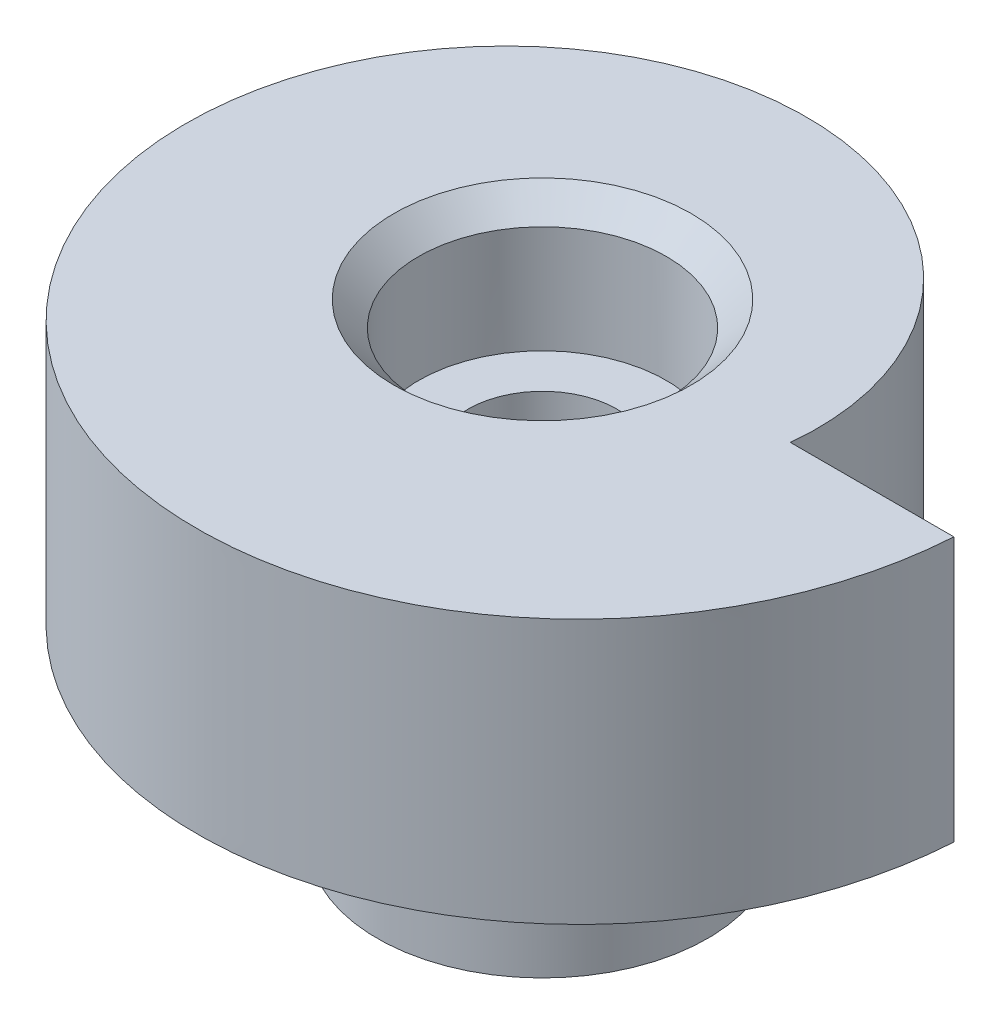
ISO-10303-21;
HEADER;
FILE_DESCRIPTION(('STEP AP214'),'2;1');
FILE_NAME('part.step','',(''),(''),'','','');
FILE_SCHEMA(('AUTOMOTIVE_DESIGN { 1 0 10303 214 1 1 1 1 }'));
ENDSEC;
DATA;
#1=APPLICATION_CONTEXT('core data for automotive mechanical design processes');
#2=APPLICATION_PROTOCOL_DEFINITION('international standard','automotive_design',2000,#1);
#3=PRODUCT_CONTEXT('',#1,'mechanical');
#4=PRODUCT('Part','Part','',(#3));
#5=PRODUCT_RELATED_PRODUCT_CATEGORY('part','',(#4));
#6=PRODUCT_DEFINITION_FORMATION('','',#4);
#7=PRODUCT_DEFINITION_CONTEXT('part definition',#1,'design');
#8=PRODUCT_DEFINITION('design','',#6,#7);
#9=PRODUCT_DEFINITION_SHAPE('','',#8);
#10=(LENGTH_UNIT() NAMED_UNIT(*) SI_UNIT(.MILLI.,.METRE.));
#11=(NAMED_UNIT(*) PLANE_ANGLE_UNIT() SI_UNIT($,.RADIAN.));
#12=(NAMED_UNIT(*) SI_UNIT($,.STERADIAN.) SOLID_ANGLE_UNIT());
#13=UNCERTAINTY_MEASURE_WITH_UNIT(LENGTH_MEASURE(1.E-05),#10,'distance_accuracy_value','');
#14=(GEOMETRIC_REPRESENTATION_CONTEXT(3) GLOBAL_UNCERTAINTY_ASSIGNED_CONTEXT((#13)) GLOBAL_UNIT_ASSIGNED_CONTEXT((#10,
#11,#12)) REPRESENTATION_CONTEXT('',''));
#15=CARTESIAN_POINT('',(0.,0.,0.));
#16=DIRECTION('',(0.,0.,1.));
#17=DIRECTION('',(1.,0.,0.));
#18=AXIS2_PLACEMENT_3D('',#15,#16,#17);
#19=CARTESIAN_POINT('',(-7.62869291223014,0.,3.05998988633623));
#20=DIRECTION('',(0.,-1.,0.));
#21=DIRECTION('',(0.,0.,-1.));
#22=AXIS2_PLACEMENT_3D('',#19,#20,#21);
#23=PLANE('',#22);
#24=CARTESIAN_POINT('',(0.,0.,0.));
#25=DIRECTION('',(0.,-1.,0.));
#26=DIRECTION('',(0.,0.,-1.));
#27=AXIS2_PLACEMENT_3D('',#24,#25,#26);
#28=CIRCLE('',#27,5.65);
#29=CARTESIAN_POINT('',(0.,0.,-5.65));
#30=VERTEX_POINT('',#29);
#31=EDGE_CURVE('E139',#30,#30,#28,.T.);
#32=ORIENTED_EDGE('',*,*,#31,.F.);
#33=EDGE_LOOP('',(#32));
#34=FACE_BOUND('',#33,.T.);
#35=CARTESIAN_POINT('',(6.0000000000256,0.,-2.4375611801459E-10));
#36=CARTESIAN_POINT('',(6.00227211322281,0.,-0.0216391735623261));
#37=CARTESIAN_POINT('',(6.00652940736587,0.,-0.064971678314864));
#38=CARTESIAN_POINT('',(6.0151125979966,0.,-0.163427406914795));
#39=CARTESIAN_POINT('',(6.02477550925084,0.,-0.304129477528617));
#40=CARTESIAN_POINT('',(6.03047893393323,0.,-0.43480921102798));
#41=CARTESIAN_POINT('',(6.03333443386326,0.,-0.586716981964261));
#42=CARTESIAN_POINT('',(6.03269058254121,0.,-0.738270410172744));
#43=CARTESIAN_POINT('',(6.02717988389836,0.,-0.917587713881191));
#44=CARTESIAN_POINT('',(6.01061545066083,0.,-1.17231334580709));
#45=CARTESIAN_POINT('',(5.97706980435562,0.,-1.47675832118602));
#46=CARTESIAN_POINT('',(5.91823629162269,0.,-1.82950111634226));
#47=CARTESIAN_POINT('',(5.82442725919943,0.,-2.22717229059439));
#48=CARTESIAN_POINT('',(5.7046521139346,0.,-2.61786696334865));
#49=CARTESIAN_POINT('',(5.55958646798802,0.,-2.99985438146384));
#50=CARTESIAN_POINT('',(5.39001539784242,0.,-3.37162892965646));
#51=CARTESIAN_POINT('',(5.19680319018417,0.,-3.73166841207894));
#52=CARTESIAN_POINT('',(4.98089884731563,0.,-4.07857837498762));
#53=CARTESIAN_POINT('',(4.68393346374007,0.,-4.49412556995533));
#54=CARTESIAN_POINT('',(4.28641768347438,0.,-4.96134695883234));
#55=CARTESIAN_POINT('',(3.7676822884361,0.,-5.45550000666804));
#56=CARTESIAN_POINT('',(3.10952771569555,0.,-5.94248264214372));
#57=CARTESIAN_POINT('',(2.39677626735348,0.,-6.34525339556019));
#58=CARTESIAN_POINT('',(1.64056828888228,0.,-6.65881676590082));
#59=CARTESIAN_POINT('',(0.655269827021516,0.,-6.93485809977588));
#60=CARTESIAN_POINT('',(-0.364309039480111,0.,-7.0528097959619));
#61=CARTESIAN_POINT('',(-1.38957544648513,0.,-7.0108988181884));
#62=CARTESIAN_POINT('',(-2.59420727579667,0.,-6.77430744231128));
#63=CARTESIAN_POINT('',(-3.75258395876377,0.,-6.35736857247431));
#64=CARTESIAN_POINT('',(-4.99396666945988,0.,-5.62570406505568));
#65=CARTESIAN_POINT('',(-6.19559601711012,0.,-4.50038196485773));
#66=CARTESIAN_POINT('',(-7.12775993762066,0.,-3.14392340940698));
#67=CARTESIAN_POINT('',(-7.87695686030534,0.,-1.3203660612925));
#68=CARTESIAN_POINT('',(-8.18009594788286,0.,1.05994904943934));
#69=CARTESIAN_POINT('',(-7.69939025058489,0.,3.43539064774587));
#70=CARTESIAN_POINT('',(-6.51239127492808,0.,5.52195627051305));
#71=CARTESIAN_POINT('',(-5.07574785866031,0.,6.9901236036815));
#72=CARTESIAN_POINT('',(-3.72441246582885,0.,7.92502240546867));
#73=CARTESIAN_POINT('',(-2.22226811903144,0.,8.59017396417616));
#74=CARTESIAN_POINT('',(-0.623254184207499,0.,8.9662617601097));
#75=CARTESIAN_POINT('',(1.01725152391742,0.,9.04433896107404));
#76=CARTESIAN_POINT('',(2.64479309025896,0.,8.82569664688642));
#77=CARTESIAN_POINT('',(4.20724847502796,0.,8.32104532831728));
#78=CARTESIAN_POINT('',(5.47534144201885,0.,7.64611803247021));
#79=CARTESIAN_POINT('',(6.46464742393787,0.,6.91765227875417));
#80=CARTESIAN_POINT('',(7.21248361459683,0.,6.22094648019854));
#81=CARTESIAN_POINT('',(7.76062337514832,0.,5.61422558681862));
#82=CARTESIAN_POINT('',(8.25489654262495,0.,4.96289063593397));
#83=CARTESIAN_POINT('',(8.69201754642753,0.,4.27190753796325));
#84=CARTESIAN_POINT('',(9.02202269406695,0.,3.63714843486716));
#85=CARTESIAN_POINT('',(9.26593442491973,0.,3.07485438694478));
#86=CARTESIAN_POINT('',(9.44264119512099,0.,2.59586178465803));
#87=CARTESIAN_POINT('',(9.56787300363814,0.,2.20706391362166));
#88=CARTESIAN_POINT('',(9.67678988768155,0.,1.81346082490763));
#89=CARTESIAN_POINT('',(9.76926347772491,0.,1.41548257412381));
#90=CARTESIAN_POINT('',(9.83564351336308,0.,1.06475061644398));
#91=CARTESIAN_POINT('',(9.87836615059154,0.,0.785836788306947));
#92=CARTESIAN_POINT('',(9.90430378948664,0.,0.586478316297708));
#93=CARTESIAN_POINT('',(9.91892064297794,0.,0.459345015791701));
#94=CARTESIAN_POINT('',(9.92980201843313,0.,0.353837424608644));
#95=CARTESIAN_POINT('',(9.94238002366642,0.,0.217342138702699));
#96=CARTESIAN_POINT('',(9.95103517151191,0.,0.108219012832476));
#97=CARTESIAN_POINT('',(9.95565924932684,0.,0.043429626559609));
#98=CARTESIAN_POINT('',(9.95840674352348,0.,-5.41413127845317E-12));
#99=B_SPLINE_CURVE_WITH_KNOTS('',4,(#35,#36,#37,#38,#39,#40,#41,#42,#43,#44,#45,#46,#47,#48,#49,
#50,#51,#52,#53,#54,#55,#56,#57,#58,#59,#60,#61,#62,#63,#64,#65,#66,#67,#68,#69,#70,#71,#72,#73,
#74,#75,#76,#77,#78,#79,#80,#81,#82,#83,#84,#85,#86,#87,#88,#89,#90,#91,#92,#93,#94,#95,#96,#97,
#98),.UNSPECIFIED.,.F.,.F.,(5,1,1,1,1,1,1,1,1,1,1,1,1,1,1,1,1,1,1,1,1,1,1,1,1,1,1,1,1,1,1,1,1,1,
1,1,1,1,1,1,1,1,1,1,1,1,1,1,1,1,1,1,1,1,1,1,1,1,1,1,5),(0.0621623597377458,0.0638928328593039,
0.0656233059808619,0.0690842522239781,0.0708147253455362,0.0725451984670942,0.0760061447102104,
0.0794670909533265,0.0829280371964427,0.089849929682675,0.0967718500747184,0.103693770466762,
0.110615690858805,0.117537611250849,0.12445954340924,0.131381475567631,0.138303407726023,
0.145225339884414,0.159069146916673,0.172912953948932,0.186756819553157,0.200600685157382,
0.214444527689551,0.228288370221721,0.255976018338554,0.269819884915802,0.283663751493049,
0.311351426113854,0.339039092497308,0.366726833029342,0.394414459986386,0.42210219423499,
0.471739608741987,0.527114886001371,0.554802545540533,0.582490205079696,0.610177862357618,
0.63786551963554,0.66555315709287,0.6932407945502,0.720928451528436,0.748616108506673,
0.776303776968288,0.790147611199095,0.803991445429903,0.81783527297716,0.831679100524418,
0.845522928071676,0.859366755618934,0.866288677157339,0.873210598695745,0.880132520234151,
0.887054441772556,0.893976363310962,0.900898284849368,0.90435924561857,0.906089726003172,
0.907820206387773,0.909550686772375,0.911281167156976,0.914742127926179),.UNSPECIFIED.);
#100=CARTESIAN_POINT('',(6.00000000002133,0.,-2.03130397329325E-10));
#101=VERTEX_POINT('',#100);
#102=CARTESIAN_POINT('',(9.95840674352343,0.,-4.51136693377808E-12));
#103=VERTEX_POINT('',#102);
#104=EDGE_CURVE('E70',#101,#103,#99,.T.);
#105=ORIENTED_EDGE('',*,*,#104,.F.);
#106=DIRECTION('',(-1.,0.,-5.01765086979981E-11));
#107=VECTOR('',#106,1.);
#108=CARTESIAN_POINT('',(6.00000000002133,0.,-2.03130397329325E-10));
#109=LINE('',#108,#107);
#110=EDGE_CURVE('E59',#103,#101,#109,.T.);
#111=ORIENTED_EDGE('',*,*,#110,.F.);
#112=EDGE_LOOP('',(#105,#111));
#113=FACE_BOUND('',#112,.T.);
#114=ADVANCED_FACE('F35',(#34,#113),#23,.T.);
#115=CARTESIAN_POINT('',(0.,6.4,0.));
#116=DIRECTION('',(0.,-1.,0.));
#117=DIRECTION('',(0.,0.,-1.));
#118=AXIS2_PLACEMENT_3D('',#115,#116,#117);
#119=CYLINDRICAL_SURFACE('',#118,1.8);
#120=CARTESIAN_POINT('',(0.,3.2,0.));
#121=DIRECTION('',(0.,1.,0.));
#122=DIRECTION('',(0.,0.,1.));
#123=AXIS2_PLACEMENT_3D('',#120,#121,#122);
#124=CIRCLE('',#123,1.8);
#125=CARTESIAN_POINT('',(0.,3.2,1.8));
#126=VERTEX_POINT('',#125);
#127=EDGE_CURVE('E75',#126,#126,#124,.T.);
#128=ORIENTED_EDGE('',*,*,#127,.T.);
#129=EDGE_LOOP('',(#128));
#130=FACE_BOUND('',#129,.T.);
#131=CARTESIAN_POINT('',(0.,-5.,0.));
#132=DIRECTION('',(0.,-1.,0.));
#133=DIRECTION('',(0.,0.,-1.));
#134=AXIS2_PLACEMENT_3D('',#131,#132,#133);
#135=CIRCLE('',#134,1.8);
#136=CARTESIAN_POINT('',(0.,-5.,-1.8));
#137=VERTEX_POINT('',#136);
#138=EDGE_CURVE('E135',#137,#137,#135,.T.);
#139=ORIENTED_EDGE('',*,*,#138,.T.);
#140=EDGE_LOOP('',(#139));
#141=FACE_BOUND('',#140,.T.);
#142=ADVANCED_FACE('F109',(#130,#141),#119,.F.);
#143=CARTESIAN_POINT('',(-7.62869291223014,6.4,3.05998988633623));
#144=DIRECTION('',(0.,-1.,0.));
#145=DIRECTION('',(0.,0.,-1.));
#146=AXIS2_PLACEMENT_3D('',#143,#144,#145);
#147=PLANE('',#146);
#148=CARTESIAN_POINT('',(0.,6.4,0.));
#149=DIRECTION('',(0.,-1.,0.));
#150=DIRECTION('',(0.,0.,-1.));
#151=AXIS2_PLACEMENT_3D('',#148,#149,#150);
#152=CIRCLE('',#151,3.6);
#153=CARTESIAN_POINT('',(0.,6.4,-3.6));
#154=VERTEX_POINT('',#153);
#155=EDGE_CURVE('E11',#154,#154,#152,.T.);
#156=ORIENTED_EDGE('',*,*,#155,.T.);
#157=EDGE_LOOP('',(#156));
#158=FACE_BOUND('',#157,.T.);
#159=CARTESIAN_POINT('',(6.0000000000256,6.4,-2.4375611801459E-10));
#160=CARTESIAN_POINT('',(6.00227211322281,6.4,-0.0216391735623261));
#161=CARTESIAN_POINT('',(6.00652940736587,6.4,-0.064971678314864));
#162=CARTESIAN_POINT('',(6.0151125979966,6.4,-0.163427406914795));
#163=CARTESIAN_POINT('',(6.02477550925084,6.4,-0.304129477528617));
#164=CARTESIAN_POINT('',(6.03047893393323,6.4,-0.43480921102798));
#165=CARTESIAN_POINT('',(6.03333443386326,6.4,-0.586716981964261));
#166=CARTESIAN_POINT('',(6.03269058254121,6.4,-0.738270410172744));
#167=CARTESIAN_POINT('',(6.02717988389836,6.4,-0.917587713881191));
#168=CARTESIAN_POINT('',(6.01061545066083,6.4,-1.17231334580709));
#169=CARTESIAN_POINT('',(5.97706980435562,6.4,-1.47675832118602));
#170=CARTESIAN_POINT('',(5.91823629162269,6.4,-1.82950111634226));
#171=CARTESIAN_POINT('',(5.82442725919943,6.4,-2.22717229059439));
#172=CARTESIAN_POINT('',(5.7046521139346,6.4,-2.61786696334865));
#173=CARTESIAN_POINT('',(5.55958646798802,6.4,-2.99985438146384));
#174=CARTESIAN_POINT('',(5.39001539784242,6.4,-3.37162892965646));
#175=CARTESIAN_POINT('',(5.19680319018417,6.4,-3.73166841207894));
#176=CARTESIAN_POINT('',(4.98089884731563,6.4,-4.07857837498762));
#177=CARTESIAN_POINT('',(4.68393346374007,6.4,-4.49412556995533));
#178=CARTESIAN_POINT('',(4.28641768347438,6.4,-4.96134695883234));
#179=CARTESIAN_POINT('',(3.7676822884361,6.4,-5.45550000666804));
#180=CARTESIAN_POINT('',(3.10952771569555,6.4,-5.94248264214372));
#181=CARTESIAN_POINT('',(2.39677626735348,6.4,-6.34525339556019));
#182=CARTESIAN_POINT('',(1.64056828888228,6.4,-6.65881676590082));
#183=CARTESIAN_POINT('',(0.655269827021516,6.4,-6.93485809977588));
#184=CARTESIAN_POINT('',(-0.364309039480111,6.4,-7.0528097959619));
#185=CARTESIAN_POINT('',(-1.38957544648513,6.4,-7.0108988181884));
#186=CARTESIAN_POINT('',(-2.59420727579667,6.4,-6.77430744231128));
#187=CARTESIAN_POINT('',(-3.75258395876377,6.4,-6.35736857247431));
#188=CARTESIAN_POINT('',(-4.99396666945988,6.4,-5.62570406505568));
#189=CARTESIAN_POINT('',(-6.19559601711012,6.4,-4.50038196485773));
#190=CARTESIAN_POINT('',(-7.12775993762066,6.4,-3.14392340940698));
#191=CARTESIAN_POINT('',(-7.87695686030534,6.4,-1.3203660612925));
#192=CARTESIAN_POINT('',(-8.18009594788286,6.4,1.05994904943934));
#193=CARTESIAN_POINT('',(-7.69939025058489,6.4,3.43539064774587));
#194=CARTESIAN_POINT('',(-6.51239127492808,6.4,5.52195627051305));
#195=CARTESIAN_POINT('',(-5.07574785866031,6.4,6.9901236036815));
#196=CARTESIAN_POINT('',(-3.72441246582885,6.4,7.92502240546867));
#197=CARTESIAN_POINT('',(-2.22226811903144,6.4,8.59017396417616));
#198=CARTESIAN_POINT('',(-0.623254184207499,6.4,8.9662617601097));
#199=CARTESIAN_POINT('',(1.01725152391742,6.4,9.04433896107404));
#200=CARTESIAN_POINT('',(2.64479309025896,6.4,8.82569664688642));
#201=CARTESIAN_POINT('',(4.20724847502796,6.4,8.32104532831728));
#202=CARTESIAN_POINT('',(5.47534144201885,6.4,7.64611803247021));
#203=CARTESIAN_POINT('',(6.46464742393787,6.4,6.91765227875417));
#204=CARTESIAN_POINT('',(7.21248361459683,6.4,6.22094648019854));
#205=CARTESIAN_POINT('',(7.76062337514832,6.4,5.61422558681862));
#206=CARTESIAN_POINT('',(8.25489654262495,6.4,4.96289063593397));
#207=CARTESIAN_POINT('',(8.69201754642753,6.4,4.27190753796325));
#208=CARTESIAN_POINT('',(9.02202269406695,6.4,3.63714843486716));
#209=CARTESIAN_POINT('',(9.26593442491973,6.4,3.07485438694478));
#210=CARTESIAN_POINT('',(9.44264119512099,6.4,2.59586178465803));
#211=CARTESIAN_POINT('',(9.56787300363814,6.4,2.20706391362166));
#212=CARTESIAN_POINT('',(9.67678988768155,6.4,1.81346082490763));
#213=CARTESIAN_POINT('',(9.76926347772491,6.4,1.41548257412381));
#214=CARTESIAN_POINT('',(9.83564351336308,6.4,1.06475061644398));
#215=CARTESIAN_POINT('',(9.87836615059154,6.4,0.785836788306947));
#216=CARTESIAN_POINT('',(9.90430378948664,6.4,0.586478316297708));
#217=CARTESIAN_POINT('',(9.91892064297794,6.4,0.459345015791701));
#218=CARTESIAN_POINT('',(9.92980201843313,6.4,0.353837424608644));
#219=CARTESIAN_POINT('',(9.94238002366642,6.4,0.217342138702699));
#220=CARTESIAN_POINT('',(9.95103517151191,6.4,0.108219012832476));
#221=CARTESIAN_POINT('',(9.95565924932684,6.4,0.043429626559609));
#222=CARTESIAN_POINT('',(9.95840674352348,6.4,-5.41413127845317E-12));
#223=B_SPLINE_CURVE_WITH_KNOTS('',4,(#159,#160,#161,#162,#163,#164,#165,#166,#167,#168,#169,
#170,#171,#172,#173,#174,#175,#176,#177,#178,#179,#180,#181,#182,#183,#184,#185,#186,#187,#188,
#189,#190,#191,#192,#193,#194,#195,#196,#197,#198,#199,#200,#201,#202,#203,#204,#205,#206,#207,
#208,#209,#210,#211,#212,#213,#214,#215,#216,#217,#218,#219,#220,#221,#222),.UNSPECIFIED.,.F.,
.F.,(5,1,1,1,1,1,1,1,1,1,1,1,1,1,1,1,1,1,1,1,1,1,1,1,1,1,1,1,1,1,1,1,1,1,1,1,1,1,1,1,1,1,1,1,1,
1,1,1,1,1,1,1,1,1,1,1,1,1,1,1,5),(0.0621623597377458,0.0638928328593039,0.0656233059808619,
0.0690842522239781,0.0708147253455362,0.0725451984670942,0.0760061447102104,0.0794670909533265,
0.0829280371964427,0.089849929682675,0.0967718500747184,0.103693770466762,0.110615690858805,
0.117537611250849,0.12445954340924,0.131381475567631,0.138303407726023,0.145225339884414,
0.159069146916673,0.172912953948932,0.186756819553157,0.200600685157382,0.214444527689551,
0.228288370221721,0.255976018338554,0.269819884915802,0.283663751493049,0.311351426113854,
0.339039092497308,0.366726833029342,0.394414459986386,0.42210219423499,0.471739608741987,
0.527114886001371,0.554802545540533,0.582490205079696,0.610177862357618,0.63786551963554,
0.66555315709287,0.6932407945502,0.720928451528436,0.748616108506673,0.776303776968288,
0.790147611199095,0.803991445429903,0.81783527297716,0.831679100524418,0.845522928071676,
0.859366755618934,0.866288677157339,0.873210598695745,0.880132520234151,0.887054441772556,
0.893976363310962,0.900898284849368,0.90435924561857,0.906089726003172,0.907820206387773,
0.909550686772375,0.911281167156976,0.914742127926179),.UNSPECIFIED.);
#224=CARTESIAN_POINT('',(6.00000000002133,6.4,-2.03130397329325E-10));
#225=VERTEX_POINT('',#224);
#226=CARTESIAN_POINT('',(9.95840674352343,6.4,-4.51136693377808E-12));
#227=VERTEX_POINT('',#226);
#228=EDGE_CURVE('E69',#225,#227,#223,.T.);
#229=ORIENTED_EDGE('',*,*,#228,.T.);
#230=DIRECTION('',(-1.,0.,-5.01765086979981E-11));
#231=VECTOR('',#230,1.);
#232=CARTESIAN_POINT('',(6.00000000002133,6.4,-2.03130397329325E-10));
#233=LINE('',#232,#231);
#234=EDGE_CURVE('E51',#227,#225,#233,.T.);
#235=ORIENTED_EDGE('',*,*,#234,.T.);
#236=EDGE_LOOP('',(#229,#235));
#237=FACE_BOUND('',#236,.T.);
#238=ADVANCED_FACE('F115',(#158,#237),#147,.F.);
#239=DIRECTION('',(0.,-1.,0.));
#240=VECTOR('',#239,1.);
#241=SURFACE_OF_LINEAR_EXTRUSION('',#223,#240);
#242=ORIENTED_EDGE('',*,*,#104,.T.);
#243=DIRECTION('',(0.,-1.,0.));
#244=VECTOR('',#243,1.);
#245=CARTESIAN_POINT('',(9.95840674352343,6.4,-4.51136693377808E-12));
#246=LINE('',#245,#244);
#247=EDGE_CURVE('E67',#227,#103,#246,.T.);
#248=ORIENTED_EDGE('',*,*,#247,.F.);
#249=ORIENTED_EDGE('',*,*,#228,.F.);
#250=DIRECTION('',(0.,-1.,0.));
#251=VECTOR('',#250,1.);
#252=CARTESIAN_POINT('',(6.00000000002133,6.4,-2.03130397329325E-10));
#253=LINE('',#252,#251);
#254=EDGE_CURVE('E64',#225,#101,#253,.T.);
#255=ORIENTED_EDGE('',*,*,#254,.T.);
#256=EDGE_LOOP('',(#242,#248,#249,#255));
#257=FACE_BOUND('',#256,.T.);
#258=ADVANCED_FACE('F73',(#257),#241,.F.);
#259=CARTESIAN_POINT('',(6.00000000002133,6.4,-2.03130397329325E-10));
#260=DIRECTION('',(-5.01765086979981E-11,0.,1.));
#261=DIRECTION('',(1.,0.,5.01765086979981E-11));
#262=AXIS2_PLACEMENT_3D('',#259,#260,#261);
#263=PLANE('',#262);
#264=ORIENTED_EDGE('',*,*,#110,.T.);
#265=ORIENTED_EDGE('',*,*,#254,.F.);
#266=ORIENTED_EDGE('',*,*,#234,.F.);
#267=ORIENTED_EDGE('',*,*,#247,.T.);
#268=EDGE_LOOP('',(#264,#265,#266,#267));
#269=FACE_BOUND('',#268,.T.);
#270=ADVANCED_FACE('F63',(#269),#263,.F.);
#271=CARTESIAN_POINT('',(0.,3.2,0.));
#272=DIRECTION('',(0.,1.,0.));
#273=DIRECTION('',(0.,0.,1.));
#274=AXIS2_PLACEMENT_3D('',#271,#272,#273);
#275=CYLINDRICAL_SURFACE('',#274,3.);
#276=CARTESIAN_POINT('',(0.,5.80000000000001,0.));
#277=DIRECTION('',(0.,-1.,0.));
#278=DIRECTION('',(0.,0.,-1.));
#279=AXIS2_PLACEMENT_3D('',#276,#277,#278);
#280=CIRCLE('',#279,3.);
#281=CARTESIAN_POINT('',(0.,5.80000000000001,-3.));
#282=VERTEX_POINT('',#281);
#283=EDGE_CURVE('E44',#282,#282,#280,.F.);
#284=ORIENTED_EDGE('',*,*,#283,.T.);
#285=EDGE_LOOP('',(#284));
#286=FACE_BOUND('',#285,.T.);
#287=CARTESIAN_POINT('',(0.,3.2,0.));
#288=DIRECTION('',(0.,1.,0.));
#289=DIRECTION('',(0.,0.,1.));
#290=AXIS2_PLACEMENT_3D('',#287,#288,#289);
#291=CIRCLE('',#290,3.);
#292=CARTESIAN_POINT('',(0.,3.2,3.));
#293=VERTEX_POINT('',#292);
#294=EDGE_CURVE('E78',#293,#293,#291,.T.);
#295=ORIENTED_EDGE('',*,*,#294,.F.);
#296=EDGE_LOOP('',(#295));
#297=FACE_BOUND('',#296,.T.);
#298=ADVANCED_FACE('F91',(#286,#297),#275,.F.);
#299=CARTESIAN_POINT('',(0.,3.2,0.));
#300=DIRECTION('',(0.,1.,0.));
#301=DIRECTION('',(0.,0.,1.));
#302=AXIS2_PLACEMENT_3D('',#299,#300,#301);
#303=PLANE('',#302);
#304=ORIENTED_EDGE('',*,*,#127,.F.);
#305=EDGE_LOOP('',(#304));
#306=FACE_BOUND('',#305,.T.);
#307=ORIENTED_EDGE('',*,*,#294,.T.);
#308=EDGE_LOOP('',(#307));
#309=FACE_BOUND('',#308,.T.);
#310=ADVANCED_FACE('F96',(#306,#309),#303,.T.);
#311=CARTESIAN_POINT('',(0.,5.80000000000001,0.));
#312=DIRECTION('',(0.,1.,0.));
#313=DIRECTION('',(0.,0.,1.));
#314=AXIS2_PLACEMENT_3D('',#311,#312,#313);
#315=CONICAL_SURFACE('',#314,3.,0.785398163397451);
#316=ORIENTED_EDGE('',*,*,#155,.F.);
#317=EDGE_LOOP('',(#316));
#318=FACE_BOUND('',#317,.T.);
#319=ORIENTED_EDGE('',*,*,#283,.F.);
#320=EDGE_LOOP('',(#319));
#321=FACE_BOUND('',#320,.T.);
#322=ADVANCED_FACE('F37',(#318,#321),#315,.F.);
#323=CARTESIAN_POINT('',(0.,-5.,0.));
#324=DIRECTION('',(0.,-1.,0.));
#325=DIRECTION('',(0.,0.,-1.));
#326=AXIS2_PLACEMENT_3D('',#323,#324,#325);
#327=PLANE('',#326);
#328=CARTESIAN_POINT('',(0.,-5.,0.));
#329=DIRECTION('',(0.,-1.,0.));
#330=DIRECTION('',(0.,0.,-1.));
#331=AXIS2_PLACEMENT_3D('',#328,#329,#330);
#332=CIRCLE('',#331,4.);
#333=CARTESIAN_POINT('',(0.,-5.,-4.));
#334=VERTEX_POINT('',#333);
#335=EDGE_CURVE('E132',#334,#334,#332,.T.);
#336=ORIENTED_EDGE('',*,*,#335,.T.);
#337=EDGE_LOOP('',(#336));
#338=FACE_BOUND('',#337,.T.);
#339=ORIENTED_EDGE('',*,*,#138,.F.);
#340=EDGE_LOOP('',(#339));
#341=FACE_BOUND('',#340,.T.);
#342=ADVANCED_FACE('F95',(#338,#341),#327,.T.);
#343=CARTESIAN_POINT('',(0.,-5.,0.));
#344=DIRECTION('',(0.,1.,0.));
#345=DIRECTION('',(0.,0.,1.));
#346=AXIS2_PLACEMENT_3D('',#343,#344,#345);
#347=CYLINDRICAL_SURFACE('',#346,4.);
#348=ORIENTED_EDGE('',*,*,#335,.F.);
#349=EDGE_LOOP('',(#348));
#350=FACE_BOUND('',#349,.T.);
#351=CARTESIAN_POINT('',(0.,2.,0.));
#352=DIRECTION('',(0.,-1.,0.));
#353=DIRECTION('',(0.,0.,-1.));
#354=AXIS2_PLACEMENT_3D('',#351,#352,#353);
#355=CIRCLE('',#354,4.);
#356=CARTESIAN_POINT('',(0.,2.,-4.));
#357=VERTEX_POINT('',#356);
#358=EDGE_CURVE('E142',#357,#357,#355,.T.);
#359=ORIENTED_EDGE('',*,*,#358,.T.);
#360=EDGE_LOOP('',(#359));
#361=FACE_BOUND('',#360,.T.);
#362=ADVANCED_FACE('F102',(#350,#361),#347,.T.);
#363=CARTESIAN_POINT('',(0.,2.,0.));
#364=DIRECTION('',(0.,-1.,0.));
#365=DIRECTION('',(0.,0.,-1.));
#366=AXIS2_PLACEMENT_3D('',#363,#364,#365);
#367=CYLINDRICAL_SURFACE('',#366,5.65);
#368=CARTESIAN_POINT('',(0.,2.,0.));
#369=DIRECTION('',(0.,-1.,0.));
#370=DIRECTION('',(0.,0.,-1.));
#371=AXIS2_PLACEMENT_3D('',#368,#369,#370);
#372=CIRCLE('',#371,5.65);
#373=CARTESIAN_POINT('',(0.,2.,-5.65));
#374=VERTEX_POINT('',#373);
#375=EDGE_CURVE('E138',#374,#374,#372,.T.);
#376=ORIENTED_EDGE('',*,*,#375,.F.);
#377=EDGE_LOOP('',(#376));
#378=FACE_BOUND('',#377,.T.);
#379=ORIENTED_EDGE('',*,*,#31,.T.);
#380=EDGE_LOOP('',(#379));
#381=FACE_BOUND('',#380,.T.);
#382=ADVANCED_FACE('F152',(#378,#381),#367,.F.);
#383=CARTESIAN_POINT('',(0.,2.,0.));
#384=DIRECTION('',(0.,-1.,0.));
#385=DIRECTION('',(0.,0.,-1.));
#386=AXIS2_PLACEMENT_3D('',#383,#384,#385);
#387=PLANE('',#386);
#388=ORIENTED_EDGE('',*,*,#358,.F.);
#389=EDGE_LOOP('',(#388));
#390=FACE_BOUND('',#389,.T.);
#391=ORIENTED_EDGE('',*,*,#375,.T.);
#392=EDGE_LOOP('',(#391));
#393=FACE_BOUND('',#392,.T.);
#394=ADVANCED_FACE('F149',(#390,#393),#387,.T.);
#395=CLOSED_SHELL('',(#114,#142,#238,#258,#270,#298,#310,#322,#342,#362,#382,#394));
#396=MANIFOLD_SOLID_BREP('B2',#395);
#397=ADVANCED_BREP_SHAPE_REPRESENTATION('',(#18,#396),#14);
#398=SHAPE_DEFINITION_REPRESENTATION(#9,#397);
ENDSEC;
END-ISO-10303-21;
